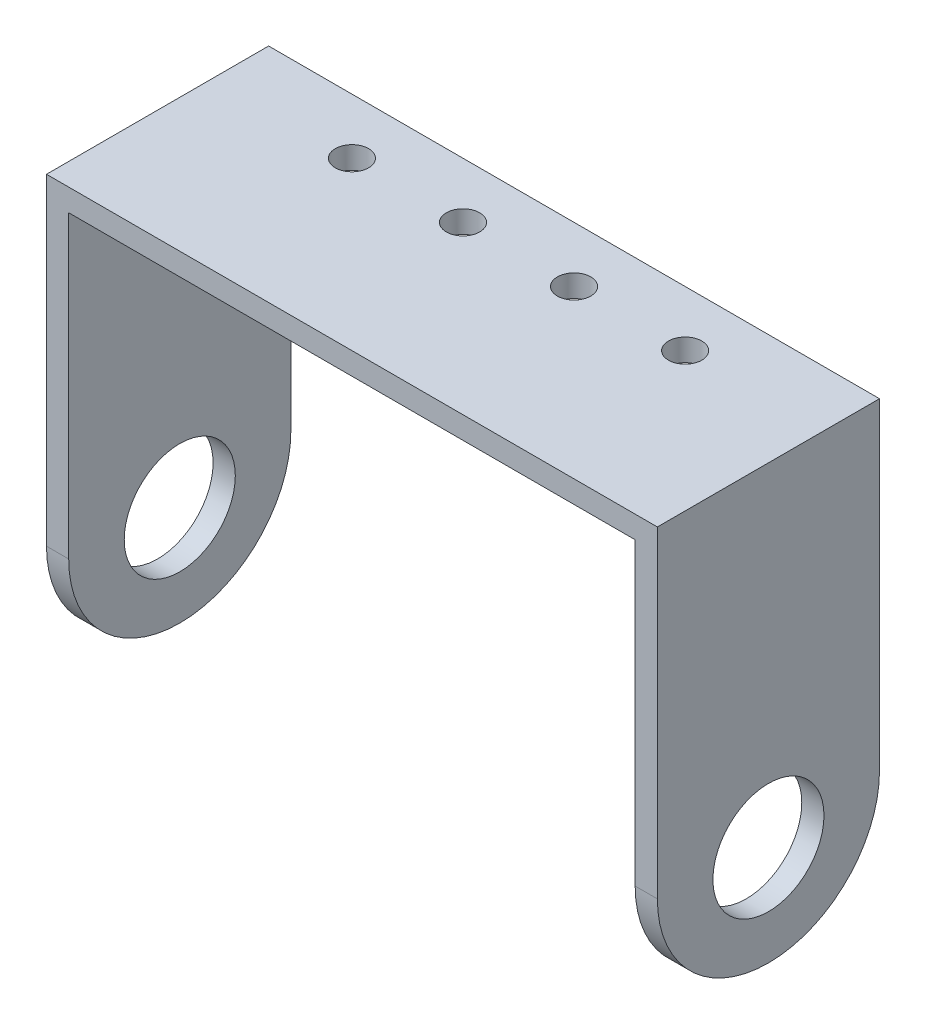
ISO-10303-21;
HEADER;
FILE_DESCRIPTION(('STEP AP214'),'2;1');
FILE_NAME('part.step','',(''),(''),'','','');
FILE_SCHEMA(('AUTOMOTIVE_DESIGN { 1 0 10303 214 1 1 1 1 }'));
ENDSEC;
DATA;
#1=APPLICATION_CONTEXT('core data for automotive mechanical design processes');
#2=APPLICATION_PROTOCOL_DEFINITION('international standard','automotive_design',2000,#1);
#3=PRODUCT_CONTEXT('',#1,'mechanical');
#4=PRODUCT('Part','Part','',(#3));
#5=PRODUCT_RELATED_PRODUCT_CATEGORY('part','',(#4));
#6=PRODUCT_DEFINITION_FORMATION('','',#4);
#7=PRODUCT_DEFINITION_CONTEXT('part definition',#1,'design');
#8=PRODUCT_DEFINITION('design','',#6,#7);
#9=PRODUCT_DEFINITION_SHAPE('','',#8);
#10=(LENGTH_UNIT() NAMED_UNIT(*) SI_UNIT(.MILLI.,.METRE.));
#11=(NAMED_UNIT(*) PLANE_ANGLE_UNIT() SI_UNIT($,.RADIAN.));
#12=(NAMED_UNIT(*) SI_UNIT($,.STERADIAN.) SOLID_ANGLE_UNIT());
#13=UNCERTAINTY_MEASURE_WITH_UNIT(LENGTH_MEASURE(1.E-05),#10,'distance_accuracy_value','');
#14=(GEOMETRIC_REPRESENTATION_CONTEXT(3) GLOBAL_UNCERTAINTY_ASSIGNED_CONTEXT((#13)) GLOBAL_UNIT_ASSIGNED_CONTEXT((#10,
#11,#12)) REPRESENTATION_CONTEXT('',''));
#15=CARTESIAN_POINT('',(0.,0.,0.));
#16=DIRECTION('',(0.,0.,1.));
#17=DIRECTION('',(1.,0.,0.));
#18=AXIS2_PLACEMENT_3D('',#15,#16,#17);
#19=CARTESIAN_POINT('',(27.5,-2.,-10.));
#20=DIRECTION('',(1.,0.,0.));
#21=DIRECTION('',(0.,0.,-1.));
#22=AXIS2_PLACEMENT_3D('',#19,#20,#21);
#23=PLANE('',#22);
#24=CARTESIAN_POINT('',(27.5,-30.,0.));
#25=DIRECTION('',(1.,0.,0.));
#26=DIRECTION('',(0.,0.,-1.));
#27=AXIS2_PLACEMENT_3D('',#24,#25,#26);
#28=CIRCLE('',#27,5.);
#29=CARTESIAN_POINT('',(27.5,-30.,-5.));
#30=VERTEX_POINT('',#29);
#31=EDGE_CURVE('E175',#30,#30,#28,.T.);
#32=ORIENTED_EDGE('',*,*,#31,.F.);
#33=EDGE_LOOP('',(#32));
#34=FACE_BOUND('',#33,.T.);
#35=DIRECTION('',(0.,1.,0.));
#36=VECTOR('',#35,1.);
#37=CARTESIAN_POINT('',(27.5,-2.,10.));
#38=LINE('',#37,#36);
#39=CARTESIAN_POINT('',(27.5,-29.,10.));
#40=VERTEX_POINT('',#39);
#41=CARTESIAN_POINT('',(27.5,0.,10.));
#42=VERTEX_POINT('',#41);
#43=EDGE_CURVE('E11',#40,#42,#38,.T.);
#44=ORIENTED_EDGE('',*,*,#43,.F.);
#45=CARTESIAN_POINT('',(27.5,-29.,0.));
#46=DIRECTION('',(-1.,0.,0.));
#47=DIRECTION('',(0.,0.,1.));
#48=AXIS2_PLACEMENT_3D('',#45,#46,#47);
#49=CIRCLE('',#48,10.);
#50=CARTESIAN_POINT('',(27.5,-29.,-10.));
#51=VERTEX_POINT('',#50);
#52=EDGE_CURVE('E111',#51,#40,#49,.T.);
#53=ORIENTED_EDGE('',*,*,#52,.F.);
#54=DIRECTION('',(0.,1.,0.));
#55=VECTOR('',#54,1.);
#56=CARTESIAN_POINT('',(27.5,-2.,-10.));
#57=LINE('',#56,#55);
#58=CARTESIAN_POINT('',(27.5,0.,-10.));
#59=VERTEX_POINT('',#58);
#60=EDGE_CURVE('E128',#51,#59,#57,.T.);
#61=ORIENTED_EDGE('',*,*,#60,.T.);
#62=DIRECTION('',(0.,0.,-1.));
#63=VECTOR('',#62,1.);
#64=CARTESIAN_POINT('',(27.5,0.,-10.));
#65=LINE('',#64,#63);
#66=EDGE_CURVE('E144',#42,#59,#65,.T.);
#67=ORIENTED_EDGE('',*,*,#66,.F.);
#68=EDGE_LOOP('',(#44,#53,#61,#67));
#69=FACE_BOUND('',#68,.T.);
#70=ADVANCED_FACE('F34',(#34,#69),#23,.T.);
#71=CARTESIAN_POINT('',(-27.5,-2.,-10.));
#72=DIRECTION('',(-1.,0.,0.));
#73=DIRECTION('',(0.,0.,1.));
#74=AXIS2_PLACEMENT_3D('',#71,#72,#73);
#75=PLANE('',#74);
#76=CARTESIAN_POINT('',(-27.5,-30.,0.));
#77=DIRECTION('',(1.,0.,0.));
#78=DIRECTION('',(0.,0.,-1.));
#79=AXIS2_PLACEMENT_3D('',#76,#77,#78);
#80=CIRCLE('',#79,5.);
#81=CARTESIAN_POINT('',(-27.5,-30.,-5.));
#82=VERTEX_POINT('',#81);
#83=EDGE_CURVE('E161',#82,#82,#80,.T.);
#84=ORIENTED_EDGE('',*,*,#83,.T.);
#85=EDGE_LOOP('',(#84));
#86=FACE_BOUND('',#85,.T.);
#87=CARTESIAN_POINT('',(-27.5,-29.,0.));
#88=DIRECTION('',(-1.,0.,0.));
#89=DIRECTION('',(0.,0.,1.));
#90=AXIS2_PLACEMENT_3D('',#87,#88,#89);
#91=CIRCLE('',#90,10.);
#92=CARTESIAN_POINT('',(-27.5,-29.,-10.));
#93=VERTEX_POINT('',#92);
#94=CARTESIAN_POINT('',(-27.5,-29.,10.));
#95=VERTEX_POINT('',#94);
#96=EDGE_CURVE('E102',#93,#95,#91,.T.);
#97=ORIENTED_EDGE('',*,*,#96,.T.);
#98=DIRECTION('',(0.,1.,0.));
#99=VECTOR('',#98,1.);
#100=CARTESIAN_POINT('',(-27.5,-2.,10.));
#101=LINE('',#100,#99);
#102=CARTESIAN_POINT('',(-27.5,0.,10.));
#103=VERTEX_POINT('',#102);
#104=EDGE_CURVE('E43',#95,#103,#101,.T.);
#105=ORIENTED_EDGE('',*,*,#104,.T.);
#106=DIRECTION('',(0.,0.,1.));
#107=VECTOR('',#106,1.);
#108=CARTESIAN_POINT('',(-27.5,0.,-10.));
#109=LINE('',#108,#107);
#110=CARTESIAN_POINT('',(-27.5,0.,-10.));
#111=VERTEX_POINT('',#110);
#112=EDGE_CURVE('E150',#111,#103,#109,.T.);
#113=ORIENTED_EDGE('',*,*,#112,.F.);
#114=DIRECTION('',(0.,1.,0.));
#115=VECTOR('',#114,1.);
#116=CARTESIAN_POINT('',(-27.5,-2.,-10.));
#117=LINE('',#116,#115);
#118=EDGE_CURVE('E108',#93,#111,#117,.T.);
#119=ORIENTED_EDGE('',*,*,#118,.F.);
#120=EDGE_LOOP('',(#97,#105,#113,#119));
#121=FACE_BOUND('',#120,.T.);
#122=ADVANCED_FACE('F104',(#86,#121),#75,.T.);
#123=CARTESIAN_POINT('',(-25.5,-39.,10.));
#124=DIRECTION('',(-1.,0.,0.));
#125=DIRECTION('',(0.,0.,1.));
#126=AXIS2_PLACEMENT_3D('',#123,#124,#125);
#127=PLANE('',#126);
#128=CARTESIAN_POINT('',(-25.5,-30.,0.));
#129=DIRECTION('',(-1.,0.,0.));
#130=DIRECTION('',(0.,0.,1.));
#131=AXIS2_PLACEMENT_3D('',#128,#129,#130);
#132=CIRCLE('',#131,5.);
#133=CARTESIAN_POINT('',(-25.5,-30.,5.));
#134=VERTEX_POINT('',#133);
#135=EDGE_CURVE('E160',#134,#134,#132,.T.);
#136=ORIENTED_EDGE('',*,*,#135,.T.);
#137=EDGE_LOOP('',(#136));
#138=FACE_BOUND('',#137,.T.);
#139=DIRECTION('',(0.,1.,0.));
#140=VECTOR('',#139,1.);
#141=CARTESIAN_POINT('',(-25.5,-39.,10.));
#142=LINE('',#141,#140);
#143=CARTESIAN_POINT('',(-25.5,-29.,10.));
#144=VERTEX_POINT('',#143);
#145=CARTESIAN_POINT('',(-25.5,-2.,10.));
#146=VERTEX_POINT('',#145);
#147=EDGE_CURVE('E37',#144,#146,#142,.T.);
#148=ORIENTED_EDGE('',*,*,#147,.F.);
#149=CARTESIAN_POINT('',(-25.5,-29.,0.));
#150=DIRECTION('',(-1.,0.,0.));
#151=DIRECTION('',(0.,0.,1.));
#152=AXIS2_PLACEMENT_3D('',#149,#150,#151);
#153=CIRCLE('',#152,10.);
#154=CARTESIAN_POINT('',(-25.5,-29.,-10.));
#155=VERTEX_POINT('',#154);
#156=EDGE_CURVE('E117',#155,#144,#153,.T.);
#157=ORIENTED_EDGE('',*,*,#156,.F.);
#158=DIRECTION('',(0.,1.,0.));
#159=VECTOR('',#158,1.);
#160=CARTESIAN_POINT('',(-25.5,-39.,-10.));
#161=LINE('',#160,#159);
#162=CARTESIAN_POINT('',(-25.5,-2.,-10.));
#163=VERTEX_POINT('',#162);
#164=EDGE_CURVE('E59',#155,#163,#161,.T.);
#165=ORIENTED_EDGE('',*,*,#164,.T.);
#166=DIRECTION('',(0.,0.,1.));
#167=VECTOR('',#166,1.);
#168=CARTESIAN_POINT('',(-25.5,-2.,10.));
#169=LINE('',#168,#167);
#170=EDGE_CURVE('E138',#163,#146,#169,.T.);
#171=ORIENTED_EDGE('',*,*,#170,.T.);
#172=EDGE_LOOP('',(#148,#157,#165,#171));
#173=FACE_BOUND('',#172,.T.);
#174=ADVANCED_FACE('F232',(#138,#173),#127,.F.);
#175=CARTESIAN_POINT('',(25.5,-39.,10.));
#176=DIRECTION('',(1.,0.,0.));
#177=DIRECTION('',(0.,0.,-1.));
#178=AXIS2_PLACEMENT_3D('',#175,#176,#177);
#179=PLANE('',#178);
#180=CARTESIAN_POINT('',(25.5,-30.,0.));
#181=DIRECTION('',(1.,0.,0.));
#182=DIRECTION('',(0.,0.,-1.));
#183=AXIS2_PLACEMENT_3D('',#180,#181,#182);
#184=CIRCLE('',#183,5.);
#185=CARTESIAN_POINT('',(25.5,-30.,-5.));
#186=VERTEX_POINT('',#185);
#187=EDGE_CURVE('E158',#186,#186,#184,.T.);
#188=ORIENTED_EDGE('',*,*,#187,.T.);
#189=EDGE_LOOP('',(#188));
#190=FACE_BOUND('',#189,.T.);
#191=CARTESIAN_POINT('',(25.5,-29.,0.));
#192=DIRECTION('',(1.,0.,0.));
#193=DIRECTION('',(0.,0.,-1.));
#194=AXIS2_PLACEMENT_3D('',#191,#192,#193);
#195=CIRCLE('',#194,10.);
#196=CARTESIAN_POINT('',(25.5,-29.,10.));
#197=VERTEX_POINT('',#196);
#198=CARTESIAN_POINT('',(25.5,-29.,-10.));
#199=VERTEX_POINT('',#198);
#200=EDGE_CURVE('E181',#197,#199,#195,.T.);
#201=ORIENTED_EDGE('',*,*,#200,.F.);
#202=DIRECTION('',(0.,1.,0.));
#203=VECTOR('',#202,1.);
#204=CARTESIAN_POINT('',(25.5,-39.,10.));
#205=LINE('',#204,#203);
#206=CARTESIAN_POINT('',(25.5,-2.,10.));
#207=VERTEX_POINT('',#206);
#208=EDGE_CURVE('E163',#197,#207,#205,.T.);
#209=ORIENTED_EDGE('',*,*,#208,.T.);
#210=DIRECTION('',(0.,0.,-1.));
#211=VECTOR('',#210,1.);
#212=CARTESIAN_POINT('',(25.5,-2.,10.));
#213=LINE('',#212,#211);
#214=CARTESIAN_POINT('',(25.5,-2.,-10.));
#215=VERTEX_POINT('',#214);
#216=EDGE_CURVE('E168',#207,#215,#213,.T.);
#217=ORIENTED_EDGE('',*,*,#216,.T.);
#218=DIRECTION('',(0.,1.,0.));
#219=VECTOR('',#218,1.);
#220=CARTESIAN_POINT('',(25.5,-39.,-10.));
#221=LINE('',#220,#219);
#222=EDGE_CURVE('E51',#199,#215,#221,.T.);
#223=ORIENTED_EDGE('',*,*,#222,.F.);
#224=EDGE_LOOP('',(#201,#209,#217,#223));
#225=FACE_BOUND('',#224,.T.);
#226=ADVANCED_FACE('F234',(#190,#225),#179,.F.);
#227=CARTESIAN_POINT('',(-27.5,-2.,-10.));
#228=DIRECTION('',(0.,0.,-1.));
#229=DIRECTION('',(-1.,0.,0.));
#230=AXIS2_PLACEMENT_3D('',#227,#228,#229);
#231=PLANE('',#230);
#232=ORIENTED_EDGE('',*,*,#60,.F.);
#233=DIRECTION('',(-1.,0.,0.));
#234=VECTOR('',#233,1.);
#235=CARTESIAN_POINT('',(27.5,-29.,-10.));
#236=LINE('',#235,#234);
#237=EDGE_CURVE('E183',#51,#199,#236,.T.);
#238=ORIENTED_EDGE('',*,*,#237,.T.);
#239=ORIENTED_EDGE('',*,*,#222,.T.);
#240=DIRECTION('',(-1.,0.,0.));
#241=VECTOR('',#240,1.);
#242=CARTESIAN_POINT('',(-27.5,-2.,-10.));
#243=LINE('',#242,#241);
#244=EDGE_CURVE('E137',#215,#163,#243,.T.);
#245=ORIENTED_EDGE('',*,*,#244,.T.);
#246=ORIENTED_EDGE('',*,*,#164,.F.);
#247=EDGE_CURVE('E184',#155,#93,#236,.T.);
#248=ORIENTED_EDGE('',*,*,#247,.T.);
#249=ORIENTED_EDGE('',*,*,#118,.T.);
#250=DIRECTION('',(-1.,0.,0.));
#251=VECTOR('',#250,1.);
#252=CARTESIAN_POINT('',(-27.5,0.,-10.));
#253=LINE('',#252,#251);
#254=EDGE_CURVE('E147',#59,#111,#253,.T.);
#255=ORIENTED_EDGE('',*,*,#254,.F.);
#256=EDGE_LOOP('',(#232,#238,#239,#245,#246,#248,#249,#255));
#257=FACE_BOUND('',#256,.T.);
#258=ADVANCED_FACE('F231',(#257),#231,.T.);
#259=CARTESIAN_POINT('',(0.,-2.,0.));
#260=DIRECTION('',(0.,1.,0.));
#261=DIRECTION('',(0.,0.,1.));
#262=AXIS2_PLACEMENT_3D('',#259,#260,#261);
#263=PLANE('',#262);
#264=CARTESIAN_POINT('',(-5.,-2.,-5.));
#265=DIRECTION('',(0.,1.,0.));
#266=DIRECTION('',(0.,0.,1.));
#267=AXIS2_PLACEMENT_3D('',#264,#265,#266);
#268=CIRCLE('',#267,1.5);
#269=CARTESIAN_POINT('',(-5.,-2.,-3.5));
#270=VERTEX_POINT('',#269);
#271=EDGE_CURVE('E205',#270,#270,#268,.T.);
#272=ORIENTED_EDGE('',*,*,#271,.T.);
#273=EDGE_LOOP('',(#272));
#274=FACE_BOUND('',#273,.T.);
#275=CARTESIAN_POINT('',(-15.,-2.,-5.));
#276=DIRECTION('',(0.,1.,0.));
#277=DIRECTION('',(0.,0.,1.));
#278=AXIS2_PLACEMENT_3D('',#275,#276,#277);
#279=CIRCLE('',#278,1.5);
#280=CARTESIAN_POINT('',(-15.,-2.,-3.5));
#281=VERTEX_POINT('',#280);
#282=EDGE_CURVE('E199',#281,#281,#279,.T.);
#283=ORIENTED_EDGE('',*,*,#282,.T.);
#284=EDGE_LOOP('',(#283));
#285=FACE_BOUND('',#284,.T.);
#286=CARTESIAN_POINT('',(15.,-2.,-5.));
#287=DIRECTION('',(0.,1.,0.));
#288=DIRECTION('',(0.,0.,1.));
#289=AXIS2_PLACEMENT_3D('',#286,#287,#288);
#290=CIRCLE('',#289,1.5);
#291=CARTESIAN_POINT('',(15.,-2.,-3.5));
#292=VERTEX_POINT('',#291);
#293=EDGE_CURVE('E193',#292,#292,#290,.T.);
#294=ORIENTED_EDGE('',*,*,#293,.T.);
#295=EDGE_LOOP('',(#294));
#296=FACE_BOUND('',#295,.T.);
#297=CARTESIAN_POINT('',(5.,-2.,-5.));
#298=DIRECTION('',(0.,1.,0.));
#299=DIRECTION('',(0.,0.,1.));
#300=AXIS2_PLACEMENT_3D('',#297,#298,#299);
#301=CIRCLE('',#300,1.5);
#302=CARTESIAN_POINT('',(5.,-2.,-3.5));
#303=VERTEX_POINT('',#302);
#304=EDGE_CURVE('E120',#303,#303,#301,.T.);
#305=ORIENTED_EDGE('',*,*,#304,.T.);
#306=EDGE_LOOP('',(#305));
#307=FACE_BOUND('',#306,.T.);
#308=ORIENTED_EDGE('',*,*,#216,.F.);
#309=DIRECTION('',(1.,0.,0.));
#310=VECTOR('',#309,1.);
#311=CARTESIAN_POINT('',(-27.5,-2.,10.));
#312=LINE('',#311,#310);
#313=EDGE_CURVE('E133',#146,#207,#312,.T.);
#314=ORIENTED_EDGE('',*,*,#313,.F.);
#315=ORIENTED_EDGE('',*,*,#170,.F.);
#316=ORIENTED_EDGE('',*,*,#244,.F.);
#317=EDGE_LOOP('',(#308,#314,#315,#316));
#318=FACE_BOUND('',#317,.T.);
#319=ADVANCED_FACE('F260',(#274,#285,#296,#307,#318),#263,.F.);
#320=CARTESIAN_POINT('',(-27.5,-2.,10.));
#321=DIRECTION('',(0.,0.,1.));
#322=DIRECTION('',(1.,0.,0.));
#323=AXIS2_PLACEMENT_3D('',#320,#321,#322);
#324=PLANE('',#323);
#325=DIRECTION('',(-1.,0.,0.));
#326=VECTOR('',#325,1.);
#327=CARTESIAN_POINT('',(27.5,-29.,10.));
#328=LINE('',#327,#326);
#329=EDGE_CURVE('E112',#40,#197,#328,.T.);
#330=ORIENTED_EDGE('',*,*,#329,.F.);
#331=ORIENTED_EDGE('',*,*,#43,.T.);
#332=DIRECTION('',(1.,0.,0.));
#333=VECTOR('',#332,1.);
#334=CARTESIAN_POINT('',(-27.5,0.,10.));
#335=LINE('',#334,#333);
#336=EDGE_CURVE('E126',#103,#42,#335,.T.);
#337=ORIENTED_EDGE('',*,*,#336,.F.);
#338=ORIENTED_EDGE('',*,*,#104,.F.);
#339=EDGE_CURVE('E115',#144,#95,#328,.T.);
#340=ORIENTED_EDGE('',*,*,#339,.F.);
#341=ORIENTED_EDGE('',*,*,#147,.T.);
#342=ORIENTED_EDGE('',*,*,#313,.T.);
#343=ORIENTED_EDGE('',*,*,#208,.F.);
#344=EDGE_LOOP('',(#330,#331,#337,#338,#340,#341,#342,#343));
#345=FACE_BOUND('',#344,.T.);
#346=ADVANCED_FACE('F124',(#345),#324,.T.);
#347=CARTESIAN_POINT('',(0.,0.,0.));
#348=DIRECTION('',(0.,1.,0.));
#349=DIRECTION('',(0.,0.,1.));
#350=AXIS2_PLACEMENT_3D('',#347,#348,#349);
#351=PLANE('',#350);
#352=CARTESIAN_POINT('',(-5.,0.,-5.));
#353=DIRECTION('',(0.,1.,0.));
#354=DIRECTION('',(0.,0.,-1.));
#355=AXIS2_PLACEMENT_3D('',#352,#353,#354);
#356=CIRCLE('',#355,1.5);
#357=CARTESIAN_POINT('',(-5.,0.,-6.5));
#358=VERTEX_POINT('',#357);
#359=EDGE_CURVE('E208',#358,#358,#356,.T.);
#360=ORIENTED_EDGE('',*,*,#359,.F.);
#361=EDGE_LOOP('',(#360));
#362=FACE_BOUND('',#361,.T.);
#363=CARTESIAN_POINT('',(-15.,0.,-5.));
#364=DIRECTION('',(0.,1.,0.));
#365=DIRECTION('',(0.,0.,-1.));
#366=AXIS2_PLACEMENT_3D('',#363,#364,#365);
#367=CIRCLE('',#366,1.5);
#368=CARTESIAN_POINT('',(-15.,0.,-6.5));
#369=VERTEX_POINT('',#368);
#370=EDGE_CURVE('E202',#369,#369,#367,.T.);
#371=ORIENTED_EDGE('',*,*,#370,.F.);
#372=EDGE_LOOP('',(#371));
#373=FACE_BOUND('',#372,.T.);
#374=CARTESIAN_POINT('',(15.,0.,-5.));
#375=DIRECTION('',(0.,1.,0.));
#376=DIRECTION('',(0.,0.,1.));
#377=AXIS2_PLACEMENT_3D('',#374,#375,#376);
#378=CIRCLE('',#377,1.5);
#379=CARTESIAN_POINT('',(15.,0.,-3.5));
#380=VERTEX_POINT('',#379);
#381=EDGE_CURVE('E196',#380,#380,#378,.T.);
#382=ORIENTED_EDGE('',*,*,#381,.F.);
#383=EDGE_LOOP('',(#382));
#384=FACE_BOUND('',#383,.T.);
#385=CARTESIAN_POINT('',(5.,0.,-5.));
#386=DIRECTION('',(0.,1.,0.));
#387=DIRECTION('',(0.,0.,1.));
#388=AXIS2_PLACEMENT_3D('',#385,#386,#387);
#389=CIRCLE('',#388,1.5);
#390=CARTESIAN_POINT('',(5.,0.,-3.5));
#391=VERTEX_POINT('',#390);
#392=EDGE_CURVE('E190',#391,#391,#389,.T.);
#393=ORIENTED_EDGE('',*,*,#392,.F.);
#394=EDGE_LOOP('',(#393));
#395=FACE_BOUND('',#394,.T.);
#396=ORIENTED_EDGE('',*,*,#66,.T.);
#397=ORIENTED_EDGE('',*,*,#254,.T.);
#398=ORIENTED_EDGE('',*,*,#112,.T.);
#399=ORIENTED_EDGE('',*,*,#336,.T.);
#400=EDGE_LOOP('',(#396,#397,#398,#399));
#401=FACE_BOUND('',#400,.T.);
#402=ADVANCED_FACE('F215',(#362,#373,#384,#395,#401),#351,.T.);
#403=CARTESIAN_POINT('',(-27.5,-30.,0.));
#404=DIRECTION('',(1.,0.,0.));
#405=DIRECTION('',(0.,0.,-1.));
#406=AXIS2_PLACEMENT_3D('',#403,#404,#405);
#407=CYLINDRICAL_SURFACE('',#406,5.);
#408=ORIENTED_EDGE('',*,*,#31,.T.);
#409=EDGE_LOOP('',(#408));
#410=FACE_BOUND('',#409,.T.);
#411=ORIENTED_EDGE('',*,*,#187,.F.);
#412=EDGE_LOOP('',(#411));
#413=FACE_BOUND('',#412,.T.);
#414=ADVANCED_FACE('F218',(#410,#413),#407,.F.);
#415=ORIENTED_EDGE('',*,*,#83,.F.);
#416=EDGE_LOOP('',(#415));
#417=FACE_BOUND('',#416,.T.);
#418=ORIENTED_EDGE('',*,*,#135,.F.);
#419=EDGE_LOOP('',(#418));
#420=FACE_BOUND('',#419,.T.);
#421=ADVANCED_FACE('F254',(#417,#420),#407,.F.);
#422=CARTESIAN_POINT('',(27.5,-29.,0.));
#423=DIRECTION('',(-1.,0.,0.));
#424=DIRECTION('',(0.,0.,1.));
#425=AXIS2_PLACEMENT_3D('',#422,#423,#424);
#426=CYLINDRICAL_SURFACE('',#425,10.);
#427=ORIENTED_EDGE('',*,*,#200,.T.);
#428=ORIENTED_EDGE('',*,*,#237,.F.);
#429=ORIENTED_EDGE('',*,*,#52,.T.);
#430=ORIENTED_EDGE('',*,*,#329,.T.);
#431=EDGE_LOOP('',(#427,#428,#429,#430));
#432=FACE_BOUND('',#431,.T.);
#433=ADVANCED_FACE('F258',(#432),#426,.T.);
#434=ORIENTED_EDGE('',*,*,#156,.T.);
#435=ORIENTED_EDGE('',*,*,#339,.T.);
#436=ORIENTED_EDGE('',*,*,#96,.F.);
#437=ORIENTED_EDGE('',*,*,#247,.F.);
#438=EDGE_LOOP('',(#434,#435,#436,#437));
#439=FACE_BOUND('',#438,.T.);
#440=ADVANCED_FACE('F116',(#439),#426,.T.);
#441=CARTESIAN_POINT('',(5.,-39.,-5.));
#442=DIRECTION('',(0.,1.,0.));
#443=DIRECTION('',(0.,0.,1.));
#444=AXIS2_PLACEMENT_3D('',#441,#442,#443);
#445=CYLINDRICAL_SURFACE('',#444,1.5);
#446=ORIENTED_EDGE('',*,*,#392,.T.);
#447=EDGE_LOOP('',(#446));
#448=FACE_BOUND('',#447,.T.);
#449=ORIENTED_EDGE('',*,*,#304,.F.);
#450=EDGE_LOOP('',(#449));
#451=FACE_BOUND('',#450,.T.);
#452=ADVANCED_FACE('F276',(#448,#451),#445,.F.);
#453=CARTESIAN_POINT('',(15.,-39.,-5.));
#454=DIRECTION('',(0.,1.,0.));
#455=DIRECTION('',(0.,0.,1.));
#456=AXIS2_PLACEMENT_3D('',#453,#454,#455);
#457=CYLINDRICAL_SURFACE('',#456,1.5);
#458=ORIENTED_EDGE('',*,*,#381,.T.);
#459=EDGE_LOOP('',(#458));
#460=FACE_BOUND('',#459,.T.);
#461=ORIENTED_EDGE('',*,*,#293,.F.);
#462=EDGE_LOOP('',(#461));
#463=FACE_BOUND('',#462,.T.);
#464=ADVANCED_FACE('F278',(#460,#463),#457,.F.);
#465=CARTESIAN_POINT('',(-15.,-39.,-5.));
#466=DIRECTION('',(0.,1.,0.));
#467=DIRECTION('',(0.,0.,1.));
#468=AXIS2_PLACEMENT_3D('',#465,#466,#467);
#469=CYLINDRICAL_SURFACE('',#468,1.5);
#470=ORIENTED_EDGE('',*,*,#370,.T.);
#471=EDGE_LOOP('',(#470));
#472=FACE_BOUND('',#471,.T.);
#473=ORIENTED_EDGE('',*,*,#282,.F.);
#474=EDGE_LOOP('',(#473));
#475=FACE_BOUND('',#474,.T.);
#476=ADVANCED_FACE('F285',(#472,#475),#469,.F.);
#477=CARTESIAN_POINT('',(-5.,-39.,-5.));
#478=DIRECTION('',(0.,1.,0.));
#479=DIRECTION('',(0.,0.,1.));
#480=AXIS2_PLACEMENT_3D('',#477,#478,#479);
#481=CYLINDRICAL_SURFACE('',#480,1.5);
#482=ORIENTED_EDGE('',*,*,#359,.T.);
#483=EDGE_LOOP('',(#482));
#484=FACE_BOUND('',#483,.T.);
#485=ORIENTED_EDGE('',*,*,#271,.F.);
#486=EDGE_LOOP('',(#485));
#487=FACE_BOUND('',#486,.T.);
#488=ADVANCED_FACE('F212',(#484,#487),#481,.F.);
#489=CLOSED_SHELL('',(#70,#122,#174,#226,#258,#319,#346,#402,#414,#421,#433,#440,#452,#464,#476,#488));
#490=MANIFOLD_SOLID_BREP('B2',#489);
#491=ADVANCED_BREP_SHAPE_REPRESENTATION('',(#18,#490),#14);
#492=SHAPE_DEFINITION_REPRESENTATION(#9,#491);
ENDSEC;
END-ISO-10303-21;
